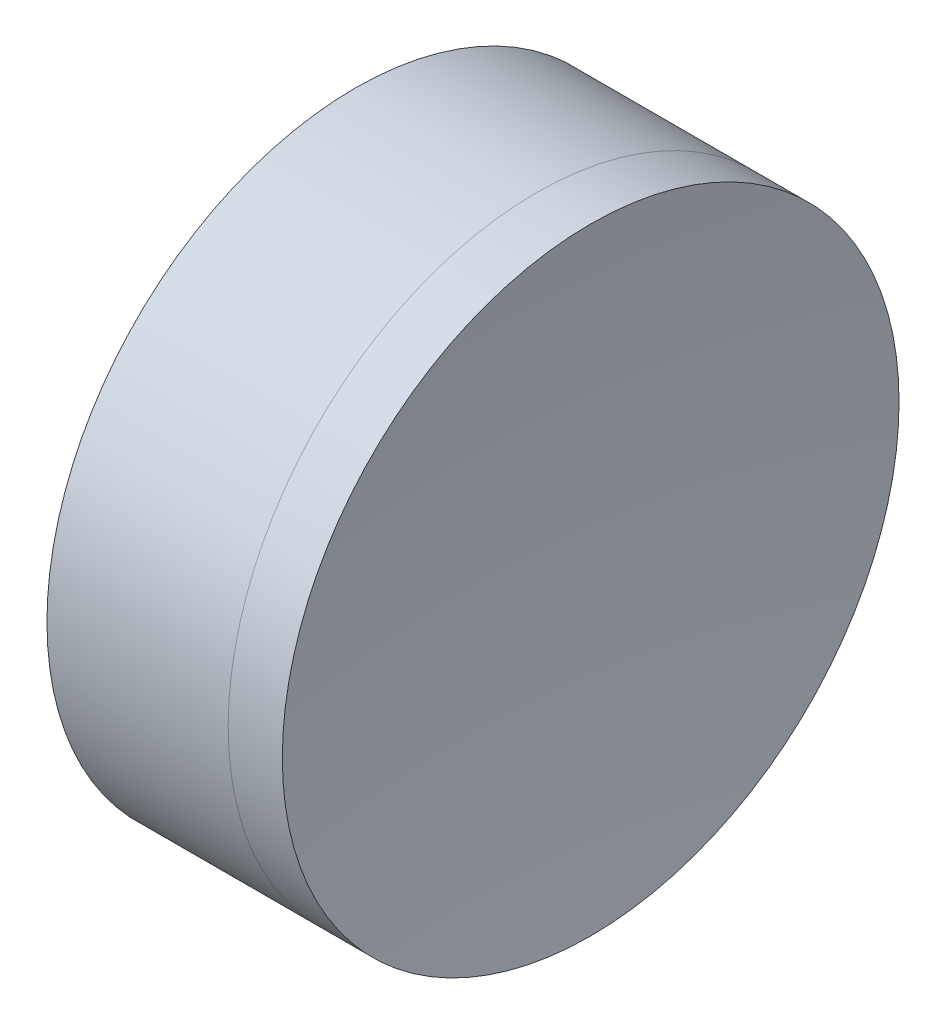
ISO-10303-21;
HEADER;
FILE_DESCRIPTION(('STEP AP214'),'2;1');
FILE_NAME('part.step','',(''),(''),'','','');
FILE_SCHEMA(('AUTOMOTIVE_DESIGN { 1 0 10303 214 1 1 1 1 }'));
ENDSEC;
DATA;
#1=APPLICATION_CONTEXT('core data for automotive mechanical design processes');
#2=APPLICATION_PROTOCOL_DEFINITION('international standard','automotive_design',2000,#1);
#3=PRODUCT_CONTEXT('',#1,'mechanical');
#4=PRODUCT('Part','Part','',(#3));
#5=PRODUCT_RELATED_PRODUCT_CATEGORY('part','',(#4));
#6=PRODUCT_DEFINITION_FORMATION('','',#4);
#7=PRODUCT_DEFINITION_CONTEXT('part definition',#1,'design');
#8=PRODUCT_DEFINITION('design','',#6,#7);
#9=PRODUCT_DEFINITION_SHAPE('','',#8);
#10=(LENGTH_UNIT() NAMED_UNIT(*) SI_UNIT(.MILLI.,.METRE.));
#11=(NAMED_UNIT(*) PLANE_ANGLE_UNIT() SI_UNIT($,.RADIAN.));
#12=(NAMED_UNIT(*) SI_UNIT($,.STERADIAN.) SOLID_ANGLE_UNIT());
#13=UNCERTAINTY_MEASURE_WITH_UNIT(LENGTH_MEASURE(1.E-05),#10,'distance_accuracy_value','');
#14=(GEOMETRIC_REPRESENTATION_CONTEXT(3) GLOBAL_UNCERTAINTY_ASSIGNED_CONTEXT((#13)) GLOBAL_UNIT_ASSIGNED_CONTEXT((#10,
#11,#12)) REPRESENTATION_CONTEXT('',''));
#15=CARTESIAN_POINT('',(0.,0.,0.));
#16=DIRECTION('',(0.,0.,1.));
#17=DIRECTION('',(1.,0.,0.));
#18=AXIS2_PLACEMENT_3D('',#15,#16,#17);
#19=CARTESIAN_POINT('',(302.843773228777,0.,0.));
#20=DIRECTION('',(-1.,0.,0.));
#21=DIRECTION('',(0.,0.,-1.));
#22=AXIS2_PLACEMENT_3D('',#19,#20,#21);
#23=SPHERICAL_SURFACE('',#22,48.31);
#24=CARTESIAN_POINT('',(258.868142477189,0.,0.));
#25=DIRECTION('',(-1.,0.,0.));
#26=DIRECTION('',(0.,0.,1.));
#27=AXIS2_PLACEMENT_3D('',#24,#25,#26);
#28=CIRCLE('',#27,20.);
#29=CARTESIAN_POINT('',(258.868142477189,0.,20.));
#30=VERTEX_POINT('',#29);
#31=EDGE_CURVE('E11',#30,#30,#28,.T.);
#32=ORIENTED_EDGE('',*,*,#31,.T.);
#33=EDGE_LOOP('',(#32));
#34=FACE_BOUND('',#33,.T.);
#35=ADVANCED_FACE('F45',(#34),#23,.T.);
#36=CARTESIAN_POINT('',(247.114403728975,0.,0.));
#37=DIRECTION('',(-1.,0.,0.));
#38=DIRECTION('',(0.,0.,1.));
#39=AXIS2_PLACEMENT_3D('',#36,#37,#38);
#40=CYLINDRICAL_SURFACE('',#39,20.);
#41=CARTESIAN_POINT('',(262.38215623797,0.,0.));
#42=DIRECTION('',(-1.,0.,0.));
#43=DIRECTION('',(0.,0.,1.));
#44=AXIS2_PLACEMENT_3D('',#41,#42,#43);
#45=CIRCLE('',#44,20.);
#46=CARTESIAN_POINT('',(262.38215623797,0.,20.));
#47=VERTEX_POINT('',#46);
#48=EDGE_CURVE('E51',#47,#47,#45,.T.);
#49=ORIENTED_EDGE('',*,*,#48,.T.);
#50=EDGE_LOOP('',(#49));
#51=FACE_BOUND('',#50,.T.);
#52=ORIENTED_EDGE('',*,*,#31,.F.);
#53=EDGE_LOOP('',(#52));
#54=FACE_BOUND('',#53,.T.);
#55=ADVANCED_FACE('F57',(#51,#54),#40,.T.);
#56=CARTESIAN_POINT('',(410.033773228777,0.,0.));
#57=DIRECTION('',(-1.,0.,0.));
#58=DIRECTION('',(0.,0.,-1.));
#59=AXIS2_PLACEMENT_3D('',#56,#57,#58);
#60=SPHERICAL_SURFACE('',#59,149.);
#61=ORIENTED_EDGE('',*,*,#48,.F.);
#62=EDGE_LOOP('',(#61));
#63=FACE_BOUND('',#62,.T.);
#64=ADVANCED_FACE('F60',(#63),#60,.F.);
#65=CLOSED_SHELL('',(#35,#55,#64));
#66=MANIFOLD_SOLID_BREP('B2',#65);
#67=CARTESIAN_POINT('',(190.333773228777,0.,0.));
#68=DIRECTION('',(-1.,0.,0.));
#69=DIRECTION('',(0.,0.,1.));
#70=AXIS2_PLACEMENT_3D('',#67,#68,#69);
#71=SPHERICAL_SURFACE('',#70,60.2);
#72=CARTESIAN_POINT('',(247.114403728975,0.,0.));
#73=DIRECTION('',(-1.,0.,0.));
#74=DIRECTION('',(0.,0.,1.));
#75=AXIS2_PLACEMENT_3D('',#72,#73,#74);
#76=CIRCLE('',#75,20.);
#77=CARTESIAN_POINT('',(247.114403728975,0.,20.));
#78=VERTEX_POINT('',#77);
#79=EDGE_CURVE('E44',#78,#78,#76,.T.);
#80=ORIENTED_EDGE('',*,*,#79,.T.);
#81=EDGE_LOOP('',(#80));
#82=FACE_BOUND('',#81,.T.);
#83=ADVANCED_FACE('F86',(#82),#71,.F.);
#84=CARTESIAN_POINT('',(-0.816062176165804,0.,0.));
#85=DIRECTION('',(-1.,0.,0.));
#86=DIRECTION('',(0.,0.,1.));
#87=AXIS2_PLACEMENT_3D('',#84,#85,#86);
#88=CYLINDRICAL_SURFACE('',#87,20.);
#89=CARTESIAN_POINT('',(258.868142477189,0.,0.));
#90=DIRECTION('',(-1.,0.,0.));
#91=DIRECTION('',(0.,0.,1.));
#92=AXIS2_PLACEMENT_3D('',#89,#90,#91);
#93=CIRCLE('',#92,20.);
#94=CARTESIAN_POINT('',(258.868142477189,0.,20.));
#95=VERTEX_POINT('',#94);
#96=EDGE_CURVE('E92',#95,#95,#93,.T.);
#97=ORIENTED_EDGE('',*,*,#96,.T.);
#98=EDGE_LOOP('',(#97));
#99=FACE_BOUND('',#98,.T.);
#100=ORIENTED_EDGE('',*,*,#79,.F.);
#101=EDGE_LOOP('',(#100));
#102=FACE_BOUND('',#101,.T.);
#103=ADVANCED_FACE('F98',(#99,#102),#88,.T.);
#104=CARTESIAN_POINT('',(302.843773228777,0.,0.));
#105=DIRECTION('',(-1.,0.,0.));
#106=DIRECTION('',(0.,0.,-1.));
#107=AXIS2_PLACEMENT_3D('',#104,#105,#106);
#108=SPHERICAL_SURFACE('',#107,48.31);
#109=ORIENTED_EDGE('',*,*,#96,.F.);
#110=EDGE_LOOP('',(#109));
#111=FACE_BOUND('',#110,.T.);
#112=ADVANCED_FACE('F101',(#111),#108,.F.);
#113=CLOSED_SHELL('',(#83,#103,#112));
#114=MANIFOLD_SOLID_BREP('B6',#113);
#115=ADVANCED_BREP_SHAPE_REPRESENTATION('',(#18,#66,#114),#14);
#116=SHAPE_DEFINITION_REPRESENTATION(#9,#115);
ENDSEC;
END-ISO-10303-21;
